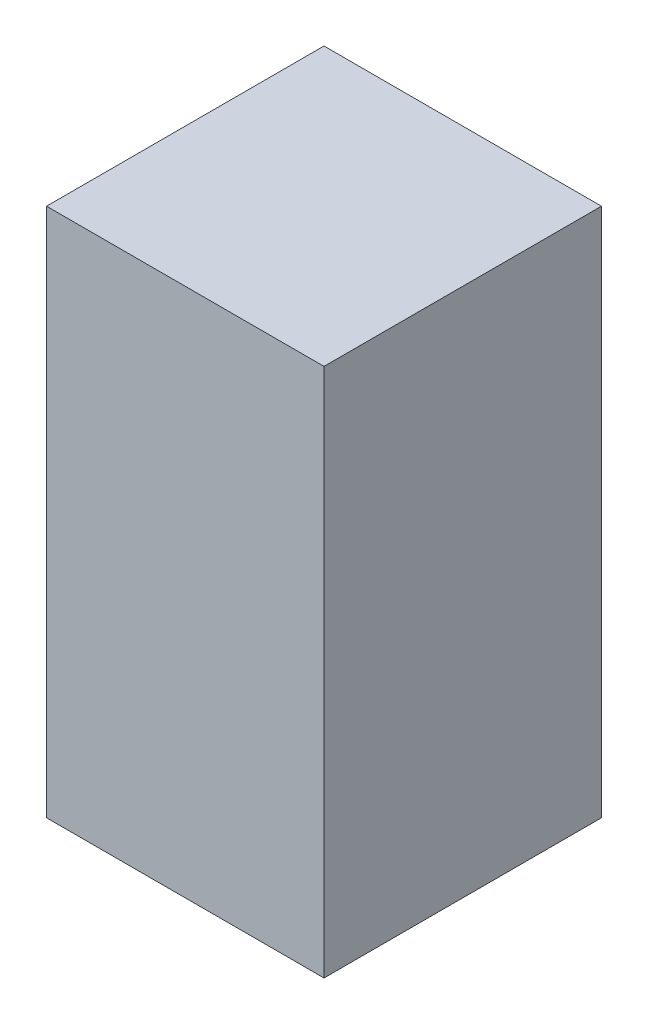
ISO-10303-21;
HEADER;
FILE_DESCRIPTION(('STEP AP214'),'2;1');
FILE_NAME('part.step','',(''),(''),'','','');
FILE_SCHEMA(('AUTOMOTIVE_DESIGN { 1 0 10303 214 1 1 1 1 }'));
ENDSEC;
DATA;
#1=APPLICATION_CONTEXT('core data for automotive mechanical design processes');
#2=APPLICATION_PROTOCOL_DEFINITION('international standard','automotive_design',2000,#1);
#3=PRODUCT_CONTEXT('',#1,'mechanical');
#4=PRODUCT('Part','Part','',(#3));
#5=PRODUCT_RELATED_PRODUCT_CATEGORY('part','',(#4));
#6=PRODUCT_DEFINITION_FORMATION('','',#4);
#7=PRODUCT_DEFINITION_CONTEXT('part definition',#1,'design');
#8=PRODUCT_DEFINITION('design','',#6,#7);
#9=PRODUCT_DEFINITION_SHAPE('','',#8);
#10=(LENGTH_UNIT() NAMED_UNIT(*) SI_UNIT(.MILLI.,.METRE.));
#11=(NAMED_UNIT(*) PLANE_ANGLE_UNIT() SI_UNIT($,.RADIAN.));
#12=(NAMED_UNIT(*) SI_UNIT($,.STERADIAN.) SOLID_ANGLE_UNIT());
#13=UNCERTAINTY_MEASURE_WITH_UNIT(LENGTH_MEASURE(1.E-05),#10,'distance_accuracy_value','');
#14=(GEOMETRIC_REPRESENTATION_CONTEXT(3) GLOBAL_UNCERTAINTY_ASSIGNED_CONTEXT((#13)) GLOBAL_UNIT_ASSIGNED_CONTEXT((#10,
#11,#12)) REPRESENTATION_CONTEXT('',''));
#15=CARTESIAN_POINT('',(0.,0.,0.));
#16=DIRECTION('',(0.,0.,1.));
#17=DIRECTION('',(1.,0.,0.));
#18=AXIS2_PLACEMENT_3D('',#15,#16,#17);
#19=CARTESIAN_POINT('',(0.16500094,0.31500064,0.));
#20=DIRECTION('',(0.,-1.,0.));
#21=DIRECTION('',(-1.,0.,0.));
#22=AXIS2_PLACEMENT_3D('',#19,#20,#21);
#23=PLANE('',#22);
#24=DIRECTION('',(-1.,0.,0.));
#25=VECTOR('',#24,1.);
#26=CARTESIAN_POINT('',(0.16500094,0.31500064,0.));
#27=LINE('',#26,#25);
#28=CARTESIAN_POINT('',(0.16500094,0.31500064,0.));
#29=VERTEX_POINT('',#28);
#30=CARTESIAN_POINT('',(-0.16500094,0.31500064,0.));
#31=VERTEX_POINT('',#30);
#32=EDGE_CURVE('E11',#29,#31,#27,.T.);
#33=ORIENTED_EDGE('',*,*,#32,.T.);
#34=DIRECTION('',(0.,0.,1.));
#35=VECTOR('',#34,1.);
#36=CARTESIAN_POINT('',(-0.16500094,0.31500064,0.));
#37=LINE('',#36,#35);
#38=CARTESIAN_POINT('',(-0.16500094,0.31500064,0.32999934));
#39=VERTEX_POINT('',#38);
#40=EDGE_CURVE('E24',#31,#39,#37,.T.);
#41=ORIENTED_EDGE('',*,*,#40,.T.);
#42=DIRECTION('',(-1.,0.,0.));
#43=VECTOR('',#42,1.);
#44=CARTESIAN_POINT('',(0.16500094,0.31500064,0.32999934));
#45=LINE('',#44,#43);
#46=CARTESIAN_POINT('',(0.16500094,0.31500064,0.32999934));
#47=VERTEX_POINT('',#46);
#48=EDGE_CURVE('E87',#47,#39,#45,.T.);
#49=ORIENTED_EDGE('',*,*,#48,.F.);
#50=DIRECTION('',(0.,0.,1.));
#51=VECTOR('',#50,1.);
#52=CARTESIAN_POINT('',(0.16500094,0.31500064,0.));
#53=LINE('',#52,#51);
#54=EDGE_CURVE('E36',#29,#47,#53,.T.);
#55=ORIENTED_EDGE('',*,*,#54,.F.);
#56=EDGE_LOOP('',(#33,#41,#49,#55));
#57=FACE_BOUND('',#56,.T.);
#58=ADVANCED_FACE('F17',(#57),#23,.F.);
#59=CARTESIAN_POINT('',(-0.16500094,0.31500064,0.));
#60=DIRECTION('',(1.,0.,0.));
#61=DIRECTION('',(0.,-1.,0.));
#62=AXIS2_PLACEMENT_3D('',#59,#60,#61);
#63=PLANE('',#62);
#64=DIRECTION('',(0.,-1.,0.));
#65=VECTOR('',#64,1.);
#66=CARTESIAN_POINT('',(-0.16500094,0.31500064,0.));
#67=LINE('',#66,#65);
#68=CARTESIAN_POINT('',(-0.16500094,-0.3149981,0.));
#69=VERTEX_POINT('',#68);
#70=EDGE_CURVE('E84',#31,#69,#67,.T.);
#71=ORIENTED_EDGE('',*,*,#70,.T.);
#72=DIRECTION('',(0.,0.,1.));
#73=VECTOR('',#72,1.);
#74=CARTESIAN_POINT('',(-0.16500094,-0.3149981,0.));
#75=LINE('',#74,#73);
#76=CARTESIAN_POINT('',(-0.16500094,-0.3149981,0.32999934));
#77=VERTEX_POINT('',#76);
#78=EDGE_CURVE('E82',#69,#77,#75,.T.);
#79=ORIENTED_EDGE('',*,*,#78,.T.);
#80=DIRECTION('',(0.,-1.,0.));
#81=VECTOR('',#80,1.);
#82=CARTESIAN_POINT('',(-0.16500094,0.31500064,0.32999934));
#83=LINE('',#82,#81);
#84=EDGE_CURVE('E62',#39,#77,#83,.T.);
#85=ORIENTED_EDGE('',*,*,#84,.F.);
#86=ORIENTED_EDGE('',*,*,#40,.F.);
#87=EDGE_LOOP('',(#71,#79,#85,#86));
#88=FACE_BOUND('',#87,.T.);
#89=ADVANCED_FACE('F89',(#88),#63,.F.);
#90=CARTESIAN_POINT('',(-0.16500094,-0.3149981,0.));
#91=DIRECTION('',(0.,1.,0.));
#92=DIRECTION('',(1.,0.,0.));
#93=AXIS2_PLACEMENT_3D('',#90,#91,#92);
#94=PLANE('',#93);
#95=DIRECTION('',(1.,0.,0.));
#96=VECTOR('',#95,1.);
#97=CARTESIAN_POINT('',(-0.16500094,-0.3149981,0.));
#98=LINE('',#97,#96);
#99=CARTESIAN_POINT('',(0.16500094,-0.3149981,0.));
#100=VERTEX_POINT('',#99);
#101=EDGE_CURVE('E71',#69,#100,#98,.T.);
#102=ORIENTED_EDGE('',*,*,#101,.T.);
#103=DIRECTION('',(0.,0.,1.));
#104=VECTOR('',#103,1.);
#105=CARTESIAN_POINT('',(0.16500094,-0.3149981,0.));
#106=LINE('',#105,#104);
#107=CARTESIAN_POINT('',(0.16500094,-0.3149981,0.32999934));
#108=VERTEX_POINT('',#107);
#109=EDGE_CURVE('E65',#100,#108,#106,.T.);
#110=ORIENTED_EDGE('',*,*,#109,.T.);
#111=DIRECTION('',(1.,0.,0.));
#112=VECTOR('',#111,1.);
#113=CARTESIAN_POINT('',(-0.16500094,-0.3149981,0.32999934));
#114=LINE('',#113,#112);
#115=EDGE_CURVE('E57',#77,#108,#114,.T.);
#116=ORIENTED_EDGE('',*,*,#115,.F.);
#117=ORIENTED_EDGE('',*,*,#78,.F.);
#118=EDGE_LOOP('',(#102,#110,#116,#117));
#119=FACE_BOUND('',#118,.T.);
#120=ADVANCED_FACE('F69',(#119),#94,.F.);
#121=CARTESIAN_POINT('',(0.16500094,-0.3149981,0.));
#122=DIRECTION('',(-1.,0.,0.));
#123=DIRECTION('',(0.,1.,0.));
#124=AXIS2_PLACEMENT_3D('',#121,#122,#123);
#125=PLANE('',#124);
#126=DIRECTION('',(0.,1.,0.));
#127=VECTOR('',#126,1.);
#128=CARTESIAN_POINT('',(0.16500094,-0.3149981,0.));
#129=LINE('',#128,#127);
#130=EDGE_CURVE('E66',#100,#29,#129,.T.);
#131=ORIENTED_EDGE('',*,*,#130,.T.);
#132=ORIENTED_EDGE('',*,*,#54,.T.);
#133=DIRECTION('',(0.,1.,0.));
#134=VECTOR('',#133,1.);
#135=CARTESIAN_POINT('',(0.16500094,-0.3149981,0.32999934));
#136=LINE('',#135,#134);
#137=EDGE_CURVE('E61',#108,#47,#136,.T.);
#138=ORIENTED_EDGE('',*,*,#137,.F.);
#139=ORIENTED_EDGE('',*,*,#109,.F.);
#140=EDGE_LOOP('',(#131,#132,#138,#139));
#141=FACE_BOUND('',#140,.T.);
#142=ADVANCED_FACE('F76',(#141),#125,.F.);
#143=CARTESIAN_POINT('',(0.16500094,0.31500064,0.));
#144=DIRECTION('',(0.,0.,-1.));
#145=DIRECTION('',(-1.,0.,0.));
#146=AXIS2_PLACEMENT_3D('',#143,#144,#145);
#147=PLANE('',#146);
#148=ORIENTED_EDGE('',*,*,#130,.F.);
#149=ORIENTED_EDGE('',*,*,#101,.F.);
#150=ORIENTED_EDGE('',*,*,#70,.F.);
#151=ORIENTED_EDGE('',*,*,#32,.F.);
#152=EDGE_LOOP('',(#148,#149,#150,#151));
#153=FACE_BOUND('',#152,.T.);
#154=ADVANCED_FACE('F91',(#153),#147,.T.);
#155=CARTESIAN_POINT('',(0.16500094,0.31500064,0.32999934));
#156=DIRECTION('',(0.,0.,-1.));
#157=DIRECTION('',(-1.,0.,0.));
#158=AXIS2_PLACEMENT_3D('',#155,#156,#157);
#159=PLANE('',#158);
#160=ORIENTED_EDGE('',*,*,#48,.T.);
#161=ORIENTED_EDGE('',*,*,#84,.T.);
#162=ORIENTED_EDGE('',*,*,#115,.T.);
#163=ORIENTED_EDGE('',*,*,#137,.T.);
#164=EDGE_LOOP('',(#160,#161,#162,#163));
#165=FACE_BOUND('',#164,.T.);
#166=ADVANCED_FACE('F59',(#165),#159,.F.);
#167=CLOSED_SHELL('',(#58,#89,#120,#142,#154,#166));
#168=MANIFOLD_SOLID_BREP('B1',#167);
#169=ADVANCED_BREP_SHAPE_REPRESENTATION('',(#18,#168),#14);
#170=SHAPE_DEFINITION_REPRESENTATION(#9,#169);
ENDSEC;
END-ISO-10303-21;
